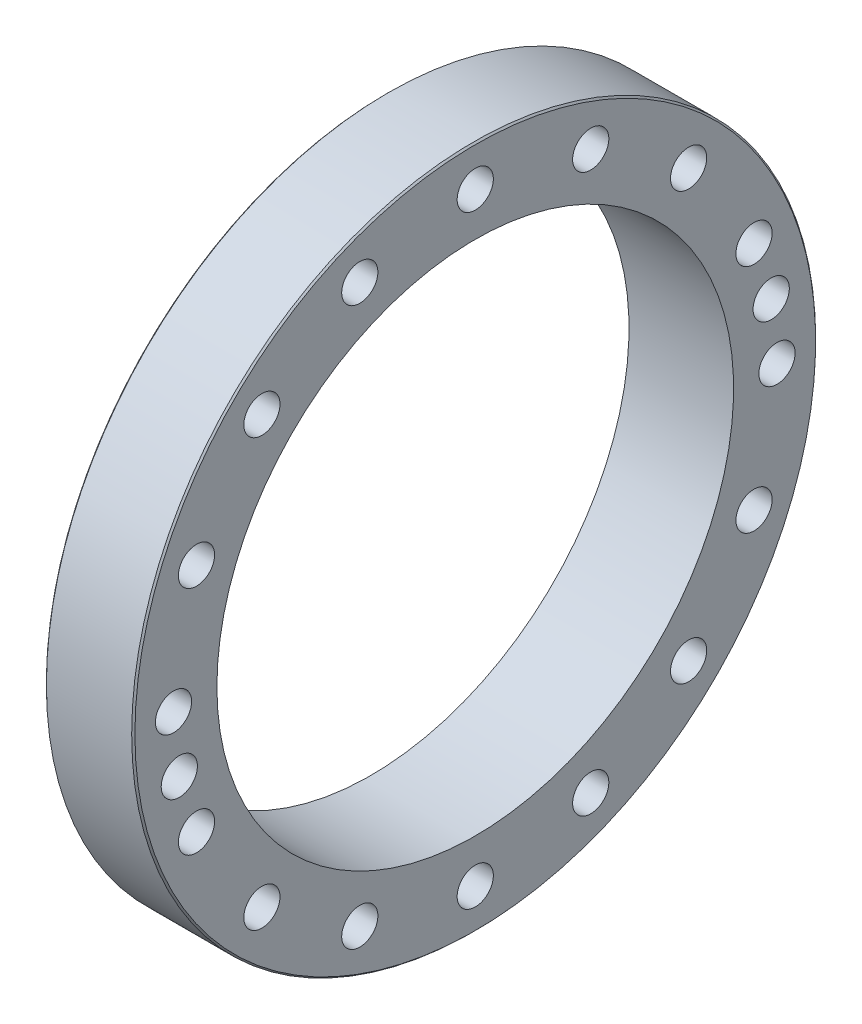
ISO-10303-21;
HEADER;
FILE_DESCRIPTION(('STEP AP214'),'2;1');
FILE_NAME('part.step','',(''),(''),'','','');
FILE_SCHEMA(('AUTOMOTIVE_DESIGN { 1 0 10303 214 1 1 1 1 }'));
ENDSEC;
DATA;
#1=APPLICATION_CONTEXT('core data for automotive mechanical design processes');
#2=APPLICATION_PROTOCOL_DEFINITION('international standard','automotive_design',2000,#1);
#3=PRODUCT_CONTEXT('',#1,'mechanical');
#4=PRODUCT('Part','Part','',(#3));
#5=PRODUCT_RELATED_PRODUCT_CATEGORY('part','',(#4));
#6=PRODUCT_DEFINITION_FORMATION('','',#4);
#7=PRODUCT_DEFINITION_CONTEXT('part definition',#1,'design');
#8=PRODUCT_DEFINITION('design','',#6,#7);
#9=PRODUCT_DEFINITION_SHAPE('','',#8);
#10=(LENGTH_UNIT() NAMED_UNIT(*) SI_UNIT(.MILLI.,.METRE.));
#11=(NAMED_UNIT(*) PLANE_ANGLE_UNIT() SI_UNIT($,.RADIAN.));
#12=(NAMED_UNIT(*) SI_UNIT($,.STERADIAN.) SOLID_ANGLE_UNIT());
#13=UNCERTAINTY_MEASURE_WITH_UNIT(LENGTH_MEASURE(1.E-05),#10,'distance_accuracy_value','');
#14=(GEOMETRIC_REPRESENTATION_CONTEXT(3) GLOBAL_UNCERTAINTY_ASSIGNED_CONTEXT((#13)) GLOBAL_UNIT_ASSIGNED_CONTEXT((#10,
#11,#12)) REPRESENTATION_CONTEXT('',''));
#15=CARTESIAN_POINT('',(0.,0.,0.));
#16=DIRECTION('',(0.,0.,1.));
#17=DIRECTION('',(1.,0.,0.));
#18=AXIS2_PLACEMENT_3D('',#15,#16,#17);
#19=CARTESIAN_POINT('',(47.6,-14.6317741512096,73.5588960302423));
#20=DIRECTION('',(-1.,0.,0.));
#21=DIRECTION('',(0.,0.,1.));
#22=AXIS2_PLACEMENT_3D('',#19,#20,#21);
#23=CYLINDRICAL_SURFACE('',#22,3.35);
#24=CARTESIAN_POINT('',(53.449999999998,-14.6317741512096,73.5588960302423));
#25=DIRECTION('',(1.,0.,0.));
#26=DIRECTION('',(0.,0.19509032201682,-0.980785280403093));
#27=AXIS2_PLACEMENT_3D('',#24,#25,#26);
#28=CIRCLE('',#27,3.34999999997575);
#29=CARTESIAN_POINT('',(53.449999999998,-13.978221572458,70.2732653409157));
#30=VERTEX_POINT('',#29);
#31=EDGE_CURVE('E30',#30,#30,#28,.T.);
#32=ORIENTED_EDGE('',*,*,#31,.T.);
#33=EDGE_LOOP('',(#32));
#34=FACE_BOUND('',#33,.T.);
#35=CARTESIAN_POINT('',(41.7499999999791,-14.6317741512096,73.5588960302423));
#36=DIRECTION('',(-1.,0.,0.));
#37=DIRECTION('',(0.,0.195090322013574,-0.980785280403739));
#38=AXIS2_PLACEMENT_3D('',#35,#36,#37);
#39=CIRCLE('',#38,3.3500000000315);
#40=CARTESIAN_POINT('',(41.7499999999791,-13.978221572458,70.2732653408589));
#41=VERTEX_POINT('',#40);
#42=EDGE_CURVE('E173',#41,#41,#39,.T.);
#43=ORIENTED_EDGE('',*,*,#42,.T.);
#44=EDGE_LOOP('',(#43));
#45=FACE_BOUND('',#44,.T.);
#46=ADVANCED_FACE('F15',(#34,#45),#23,.F.);
#47=CARTESIAN_POINT('',(47.6,14.6317741512096,-73.5588960302423));
#48=DIRECTION('',(-1.,0.,0.));
#49=DIRECTION('',(0.,0.,1.));
#50=AXIS2_PLACEMENT_3D('',#47,#48,#49);
#51=CYLINDRICAL_SURFACE('',#50,3.35);
#52=CARTESIAN_POINT('',(53.449999999998,14.6317741512096,-73.5588960302423));
#53=DIRECTION('',(1.,0.,0.));
#54=DIRECTION('',(0.,-0.19509032201682,0.980785280403093));
#55=AXIS2_PLACEMENT_3D('',#52,#53,#54);
#56=CIRCLE('',#55,3.34999999997575);
#57=CARTESIAN_POINT('',(53.449999999998,13.978221572458,-70.2732653409157));
#58=VERTEX_POINT('',#57);
#59=EDGE_CURVE('E179',#58,#58,#56,.T.);
#60=ORIENTED_EDGE('',*,*,#59,.T.);
#61=EDGE_LOOP('',(#60));
#62=FACE_BOUND('',#61,.T.);
#63=CARTESIAN_POINT('',(41.7499999999791,14.6317741512096,-73.5588960302423));
#64=DIRECTION('',(-1.,0.,0.));
#65=DIRECTION('',(0.,-0.195090322013574,0.980785280403739));
#66=AXIS2_PLACEMENT_3D('',#63,#64,#65);
#67=CIRCLE('',#66,3.3500000000315);
#68=CARTESIAN_POINT('',(41.7499999999791,13.978221572458,-70.2732653408589));
#69=VERTEX_POINT('',#68);
#70=EDGE_CURVE('E168',#69,#69,#67,.T.);
#71=ORIENTED_EDGE('',*,*,#70,.T.);
#72=EDGE_LOOP('',(#71));
#73=FACE_BOUND('',#72,.T.);
#74=ADVANCED_FACE('F191',(#62,#73),#51,.F.);
#75=CARTESIAN_POINT('',(54.1000000000054,-14.6317741512096,73.5588960302423));
#76=DIRECTION('',(1.,0.,0.));
#77=DIRECTION('',(0.,0.,-1.));
#78=AXIS2_PLACEMENT_3D('',#75,#76,#77);
#79=CONICAL_SURFACE('',#78,3.99999999999753,0.785398163408533);
#80=CARTESIAN_POINT('',(54.1000000000072,-14.6317741512096,73.5588960302423));
#81=DIRECTION('',(1.,0.,0.));
#82=DIRECTION('',(0.,0.,-1.));
#83=AXIS2_PLACEMENT_3D('',#80,#81,#82);
#84=CIRCLE('',#83,3.99999999999938);
#85=CARTESIAN_POINT('',(54.1000000000072,-14.6317741512096,69.5588960302429));
#86=VERTEX_POINT('',#85);
#87=EDGE_CURVE('E18',#86,#86,#84,.T.);
#88=ORIENTED_EDGE('',*,*,#87,.T.);
#89=EDGE_LOOP('',(#88));
#90=FACE_BOUND('',#89,.T.);
#91=ORIENTED_EDGE('',*,*,#31,.F.);
#92=EDGE_LOOP('',(#91));
#93=FACE_BOUND('',#92,.T.);
#94=ADVANCED_FACE('F188',(#90,#93),#79,.F.);
#95=CARTESIAN_POINT('',(54.1000000000054,14.6317741512096,-73.5588960302423));
#96=DIRECTION('',(1.,0.,0.));
#97=DIRECTION('',(0.,0.,-1.));
#98=AXIS2_PLACEMENT_3D('',#95,#96,#97);
#99=CONICAL_SURFACE('',#98,3.99999999999753,0.785398163408533);
#100=CARTESIAN_POINT('',(54.1000000000072,14.6317741512096,-73.5588960302423));
#101=DIRECTION('',(1.,0.,0.));
#102=DIRECTION('',(0.,0.,-1.));
#103=AXIS2_PLACEMENT_3D('',#100,#101,#102);
#104=CIRCLE('',#103,3.99999999999938);
#105=CARTESIAN_POINT('',(54.1000000000072,14.6317741512096,-77.5588960302417));
#106=VERTEX_POINT('',#105);
#107=EDGE_CURVE('E159',#106,#106,#104,.T.);
#108=ORIENTED_EDGE('',*,*,#107,.T.);
#109=EDGE_LOOP('',(#108));
#110=FACE_BOUND('',#109,.T.);
#111=ORIENTED_EDGE('',*,*,#59,.F.);
#112=EDGE_LOOP('',(#111));
#113=FACE_BOUND('',#112,.T.);
#114=ADVANCED_FACE('F190',(#110,#113),#99,.F.);
#115=CARTESIAN_POINT('',(41.0999999999149,-14.6317741512096,73.5588960302423));
#116=DIRECTION('',(-1.,0.,0.));
#117=DIRECTION('',(0.,0.,1.));
#118=AXIS2_PLACEMENT_3D('',#115,#116,#117);
#119=CONICAL_SURFACE('',#118,4.00000000005605,0.78539816336694);
#120=ORIENTED_EDGE('',*,*,#42,.F.);
#121=EDGE_LOOP('',(#120));
#122=FACE_BOUND('',#121,.T.);
#123=CARTESIAN_POINT('',(41.0999999999717,-14.6317741512096,73.5588960302423));
#124=DIRECTION('',(-1.,0.,0.));
#125=DIRECTION('',(0.,0.,1.));
#126=AXIS2_PLACEMENT_3D('',#123,#124,#125);
#127=CIRCLE('',#126,3.99999999999921);
#128=CARTESIAN_POINT('',(41.0999999999717,-14.6317741512096,77.5588960302415));
#129=VERTEX_POINT('',#128);
#130=EDGE_CURVE('E157',#129,#129,#127,.F.);
#131=ORIENTED_EDGE('',*,*,#130,.F.);
#132=EDGE_LOOP('',(#131));
#133=FACE_BOUND('',#132,.T.);
#134=ADVANCED_FACE('F198',(#122,#133),#119,.F.);
#135=CARTESIAN_POINT('',(41.0999999999149,14.6317741512096,-73.5588960302423));
#136=DIRECTION('',(-1.,0.,0.));
#137=DIRECTION('',(0.,0.,1.));
#138=AXIS2_PLACEMENT_3D('',#135,#136,#137);
#139=CONICAL_SURFACE('',#138,4.00000000005605,0.78539816336694);
#140=ORIENTED_EDGE('',*,*,#70,.F.);
#141=EDGE_LOOP('',(#140));
#142=FACE_BOUND('',#141,.T.);
#143=CARTESIAN_POINT('',(41.0999999999717,14.6317741512096,-73.5588960302423));
#144=DIRECTION('',(-1.,0.,0.));
#145=DIRECTION('',(0.,0.,1.));
#146=AXIS2_PLACEMENT_3D('',#143,#144,#145);
#147=CIRCLE('',#146,3.99999999999921);
#148=CARTESIAN_POINT('',(41.0999999999717,14.6317741512096,-69.5588960302431));
#149=VERTEX_POINT('',#148);
#150=EDGE_CURVE('E154',#149,#149,#147,.F.);
#151=ORIENTED_EDGE('',*,*,#150,.F.);
#152=EDGE_LOOP('',(#151));
#153=FACE_BOUND('',#152,.T.);
#154=ADVANCED_FACE('F317',(#142,#153),#139,.F.);
#155=CARTESIAN_POINT('',(39.5,0.,0.));
#156=DIRECTION('',(-1.,0.,0.));
#157=DIRECTION('',(0.,0.,1.));
#158=AXIS2_PLACEMENT_3D('',#155,#156,#157);
#159=CYLINDRICAL_SURFACE('',#158,67.5);
#160=CARTESIAN_POINT('',(41.1,0.,0.));
#161=DIRECTION('',(-1.,0.,0.));
#162=DIRECTION('',(0.,0.,1.));
#163=AXIS2_PLACEMENT_3D('',#160,#161,#162);
#164=CIRCLE('',#163,67.5);
#165=CARTESIAN_POINT('',(41.1,0.,67.5));
#166=VERTEX_POINT('',#165);
#167=EDGE_CURVE('E148',#166,#166,#164,.F.);
#168=ORIENTED_EDGE('',*,*,#167,.F.);
#169=EDGE_LOOP('',(#168));
#170=FACE_BOUND('',#169,.T.);
#171=CARTESIAN_POINT('',(37.9,0.,0.));
#172=DIRECTION('',(1.,0.,0.));
#173=DIRECTION('',(0.,0.,1.));
#174=AXIS2_PLACEMENT_3D('',#171,#172,#173);
#175=CIRCLE('',#174,67.5);
#176=CARTESIAN_POINT('',(37.9,0.,67.5));
#177=VERTEX_POINT('',#176);
#178=EDGE_CURVE('E164',#177,#177,#175,.F.);
#179=ORIENTED_EDGE('',*,*,#178,.F.);
#180=EDGE_LOOP('',(#179));
#181=FACE_BOUND('',#180,.T.);
#182=ADVANCED_FACE('F314',(#170,#181),#159,.T.);
#183=CARTESIAN_POINT('',(37.9,0.,0.));
#184=DIRECTION('',(1.,0.,0.));
#185=DIRECTION('',(0.,0.,-1.));
#186=AXIS2_PLACEMENT_3D('',#183,#184,#185);
#187=CONICAL_SURFACE('',#186,67.5,0.785398163397448);
#188=ORIENTED_EDGE('',*,*,#178,.T.);
#189=EDGE_LOOP('',(#188));
#190=FACE_BOUND('',#189,.T.);
#191=CARTESIAN_POINT('',(37.1,0.,0.));
#192=DIRECTION('',(1.,0.,0.));
#193=DIRECTION('',(0.,0.,-1.));
#194=AXIS2_PLACEMENT_3D('',#191,#192,#193);
#195=CIRCLE('',#194,66.7);
#196=CARTESIAN_POINT('',(37.1,0.,-66.7));
#197=VERTEX_POINT('',#196);
#198=EDGE_CURVE('E145',#197,#197,#195,.F.);
#199=ORIENTED_EDGE('',*,*,#198,.F.);
#200=EDGE_LOOP('',(#199));
#201=FACE_BOUND('',#200,.T.);
#202=ADVANCED_FACE('F310',(#190,#201),#187,.T.);
#203=CARTESIAN_POINT('',(41.5,0.,0.));
#204=DIRECTION('',(1.,0.,0.));
#205=DIRECTION('',(0.,1.,0.));
#206=AXIS2_PLACEMENT_3D('',#203,#204,#205);
#207=CONICAL_SURFACE('',#206,85.,0.785398163397457);
#208=CARTESIAN_POINT('',(41.5,0.,0.));
#209=DIRECTION('',(-1.,0.,0.));
#210=DIRECTION('',(0.,0.,1.));
#211=AXIS2_PLACEMENT_3D('',#208,#209,#210);
#212=CIRCLE('',#211,85.);
#213=CARTESIAN_POINT('',(41.5,0.,85.));
#214=VERTEX_POINT('',#213);
#215=EDGE_CURVE('E144',#214,#214,#212,.F.);
#216=ORIENTED_EDGE('',*,*,#215,.F.);
#217=EDGE_LOOP('',(#216));
#218=FACE_BOUND('',#217,.T.);
#219=CARTESIAN_POINT('',(41.1,0.,0.));
#220=DIRECTION('',(1.,0.,0.));
#221=DIRECTION('',(0.,1.,0.));
#222=AXIS2_PLACEMENT_3D('',#219,#220,#221);
#223=CIRCLE('',#222,84.6);
#224=CARTESIAN_POINT('',(41.1,84.6,0.));
#225=VERTEX_POINT('',#224);
#226=EDGE_CURVE('E151',#225,#225,#223,.F.);
#227=ORIENTED_EDGE('',*,*,#226,.F.);
#228=EDGE_LOOP('',(#227));
#229=FACE_BOUND('',#228,.T.);
#230=ADVANCED_FACE('F306',(#218,#229),#207,.T.);
#231=CARTESIAN_POINT('',(54.1,-15.0707273757459,75.7656629111495));
#232=DIRECTION('',(-1.,0.,0.));
#233=DIRECTION('',(0.,0.,1.));
#234=AXIS2_PLACEMENT_3D('',#231,#232,#233);
#235=PLANE('',#234);
#236=CARTESIAN_POINT('',(54.1,-14.6317741512096,73.5588960302423));
#237=DIRECTION('',(-1.,0.,0.));
#238=DIRECTION('',(0.,0.,1.));
#239=AXIS2_PLACEMENT_3D('',#236,#237,#238);
#240=CIRCLE('',#239,4.5);
#241=CARTESIAN_POINT('',(54.1,-14.6317741512096,78.0588960302423));
#242=VERTEX_POINT('',#241);
#243=EDGE_CURVE('E141',#242,#242,#240,.F.);
#244=ORIENTED_EDGE('',*,*,#243,.T.);
#245=EDGE_LOOP('',(#244));
#246=FACE_BOUND('',#245,.T.);
#247=ORIENTED_EDGE('',*,*,#87,.F.);
#248=EDGE_LOOP('',(#247));
#249=FACE_BOUND('',#248,.T.);
#250=ADVANCED_FACE('F302',(#246,#249),#235,.F.);
#251=CARTESIAN_POINT('',(54.1,15.0707273757459,-75.7656629111495));
#252=DIRECTION('',(-1.,0.,0.));
#253=DIRECTION('',(0.,0.,1.));
#254=AXIS2_PLACEMENT_3D('',#251,#252,#253);
#255=PLANE('',#254);
#256=CARTESIAN_POINT('',(54.1,14.6317741512096,-73.5588960302423));
#257=DIRECTION('',(-1.,0.,0.));
#258=DIRECTION('',(0.,0.,1.));
#259=AXIS2_PLACEMENT_3D('',#256,#257,#258);
#260=CIRCLE('',#259,4.5);
#261=CARTESIAN_POINT('',(54.1,14.6317741512096,-69.0588960302423));
#262=VERTEX_POINT('',#261);
#263=EDGE_CURVE('E138',#262,#262,#260,.F.);
#264=ORIENTED_EDGE('',*,*,#263,.T.);
#265=EDGE_LOOP('',(#264));
#266=FACE_BOUND('',#265,.T.);
#267=ORIENTED_EDGE('',*,*,#107,.F.);
#268=EDGE_LOOP('',(#267));
#269=FACE_BOUND('',#268,.T.);
#270=ADVANCED_FACE('F298',(#266,#269),#255,.F.);
#271=CARTESIAN_POINT('',(41.1,0.,76.05));
#272=DIRECTION('',(-1.,0.,0.));
#273=DIRECTION('',(0.,0.,1.));
#274=AXIS2_PLACEMENT_3D('',#271,#272,#273);
#275=PLANE('',#274);
#276=ORIENTED_EDGE('',*,*,#167,.T.);
#277=EDGE_LOOP('',(#276));
#278=FACE_BOUND('',#277,.T.);
#279=ORIENTED_EDGE('',*,*,#226,.T.);
#280=EDGE_LOOP('',(#279));
#281=FACE_BOUND('',#280,.T.);
#282=CARTESIAN_POINT('',(41.1,0.,-75.));
#283=DIRECTION('',(-1.,0.,0.));
#284=DIRECTION('',(0.,0.,1.));
#285=AXIS2_PLACEMENT_3D('',#282,#283,#284);
#286=CIRCLE('',#285,4.5);
#287=CARTESIAN_POINT('',(41.1,0.,-70.5));
#288=VERTEX_POINT('',#287);
#289=EDGE_CURVE('E90',#288,#288,#286,.F.);
#290=ORIENTED_EDGE('',*,*,#289,.T.);
#291=EDGE_LOOP('',(#290));
#292=FACE_BOUND('',#291,.T.);
#293=CARTESIAN_POINT('',(41.1,28.7012574273817,-69.2909649383465));
#294=DIRECTION('',(-1.,0.,0.));
#295=DIRECTION('',(0.,0.,1.));
#296=AXIS2_PLACEMENT_3D('',#293,#294,#295);
#297=CIRCLE('',#296,4.5);
#298=CARTESIAN_POINT('',(41.1,28.7012574273817,-64.7909649383465));
#299=VERTEX_POINT('',#298);
#300=EDGE_CURVE('E93',#299,#299,#297,.F.);
#301=ORIENTED_EDGE('',*,*,#300,.T.);
#302=EDGE_LOOP('',(#301));
#303=FACE_BOUND('',#302,.T.);
#304=CARTESIAN_POINT('',(41.1,53.0330085889911,-53.0330085889911));
#305=DIRECTION('',(-1.,0.,0.));
#306=DIRECTION('',(0.,0.,1.));
#307=AXIS2_PLACEMENT_3D('',#304,#305,#306);
#308=CIRCLE('',#307,4.5);
#309=CARTESIAN_POINT('',(41.1,53.0330085889911,-48.5330085889911));
#310=VERTEX_POINT('',#309);
#311=EDGE_CURVE('E96',#310,#310,#308,.F.);
#312=ORIENTED_EDGE('',*,*,#311,.T.);
#313=EDGE_LOOP('',(#312));
#314=FACE_BOUND('',#313,.T.);
#315=CARTESIAN_POINT('',(41.1,69.2909649383465,-28.7012574273817));
#316=DIRECTION('',(-1.,0.,0.));
#317=DIRECTION('',(0.,0.,1.));
#318=AXIS2_PLACEMENT_3D('',#315,#316,#317);
#319=CIRCLE('',#318,4.5);
#320=CARTESIAN_POINT('',(41.1,69.2909649383465,-24.2012574273817));
#321=VERTEX_POINT('',#320);
#322=EDGE_CURVE('E99',#321,#321,#319,.F.);
#323=ORIENTED_EDGE('',*,*,#322,.T.);
#324=EDGE_LOOP('',(#323));
#325=FACE_BOUND('',#324,.T.);
#326=CARTESIAN_POINT('',(41.1,75.,0.));
#327=DIRECTION('',(-1.,0.,0.));
#328=DIRECTION('',(0.,0.,1.));
#329=AXIS2_PLACEMENT_3D('',#326,#327,#328);
#330=CIRCLE('',#329,4.5);
#331=CARTESIAN_POINT('',(41.1,75.,4.5));
#332=VERTEX_POINT('',#331);
#333=EDGE_CURVE('E102',#332,#332,#330,.F.);
#334=ORIENTED_EDGE('',*,*,#333,.T.);
#335=EDGE_LOOP('',(#334));
#336=FACE_BOUND('',#335,.T.);
#337=CARTESIAN_POINT('',(41.1,69.2909649383465,28.7012574273817));
#338=DIRECTION('',(-1.,0.,0.));
#339=DIRECTION('',(0.,0.,1.));
#340=AXIS2_PLACEMENT_3D('',#337,#338,#339);
#341=CIRCLE('',#340,4.5);
#342=CARTESIAN_POINT('',(41.1,69.2909649383465,33.2012574273817));
#343=VERTEX_POINT('',#342);
#344=EDGE_CURVE('E105',#343,#343,#341,.F.);
#345=ORIENTED_EDGE('',*,*,#344,.T.);
#346=EDGE_LOOP('',(#345));
#347=FACE_BOUND('',#346,.T.);
#348=CARTESIAN_POINT('',(41.1,53.0330085889911,53.0330085889911));
#349=DIRECTION('',(-1.,0.,0.));
#350=DIRECTION('',(0.,0.,1.));
#351=AXIS2_PLACEMENT_3D('',#348,#349,#350);
#352=CIRCLE('',#351,4.5);
#353=CARTESIAN_POINT('',(41.1,53.0330085889911,57.5330085889911));
#354=VERTEX_POINT('',#353);
#355=EDGE_CURVE('E108',#354,#354,#352,.F.);
#356=ORIENTED_EDGE('',*,*,#355,.T.);
#357=EDGE_LOOP('',(#356));
#358=FACE_BOUND('',#357,.T.);
#359=CARTESIAN_POINT('',(41.1,28.7012574273817,69.2909649383465));
#360=DIRECTION('',(-1.,0.,0.));
#361=DIRECTION('',(0.,0.,1.));
#362=AXIS2_PLACEMENT_3D('',#359,#360,#361);
#363=CIRCLE('',#362,4.5);
#364=CARTESIAN_POINT('',(41.1,28.7012574273817,73.7909649383465));
#365=VERTEX_POINT('',#364);
#366=EDGE_CURVE('E111',#365,#365,#363,.F.);
#367=ORIENTED_EDGE('',*,*,#366,.T.);
#368=EDGE_LOOP('',(#367));
#369=FACE_BOUND('',#368,.T.);
#370=CARTESIAN_POINT('',(41.1,0.,75.));
#371=DIRECTION('',(-1.,0.,0.));
#372=DIRECTION('',(0.,0.,1.));
#373=AXIS2_PLACEMENT_3D('',#370,#371,#372);
#374=CIRCLE('',#373,4.5);
#375=CARTESIAN_POINT('',(41.1,0.,79.5));
#376=VERTEX_POINT('',#375);
#377=EDGE_CURVE('E114',#376,#376,#374,.F.);
#378=ORIENTED_EDGE('',*,*,#377,.T.);
#379=EDGE_LOOP('',(#378));
#380=FACE_BOUND('',#379,.T.);
#381=CARTESIAN_POINT('',(41.1,-28.7012574273817,69.2909649383465));
#382=DIRECTION('',(-1.,0.,0.));
#383=DIRECTION('',(0.,0.,1.));
#384=AXIS2_PLACEMENT_3D('',#381,#382,#383);
#385=CIRCLE('',#384,4.5);
#386=CARTESIAN_POINT('',(41.1,-28.7012574273817,73.7909649383465));
#387=VERTEX_POINT('',#386);
#388=EDGE_CURVE('E117',#387,#387,#385,.F.);
#389=ORIENTED_EDGE('',*,*,#388,.T.);
#390=EDGE_LOOP('',(#389));
#391=FACE_BOUND('',#390,.T.);
#392=CARTESIAN_POINT('',(41.1,-53.0330085889911,53.0330085889911));
#393=DIRECTION('',(-1.,0.,0.));
#394=DIRECTION('',(0.,0.,1.));
#395=AXIS2_PLACEMENT_3D('',#392,#393,#394);
#396=CIRCLE('',#395,4.5);
#397=CARTESIAN_POINT('',(41.1,-53.0330085889911,57.5330085889911));
#398=VERTEX_POINT('',#397);
#399=EDGE_CURVE('E120',#398,#398,#396,.F.);
#400=ORIENTED_EDGE('',*,*,#399,.T.);
#401=EDGE_LOOP('',(#400));
#402=FACE_BOUND('',#401,.T.);
#403=CARTESIAN_POINT('',(41.1,-69.2909649383465,28.7012574273817));
#404=DIRECTION('',(-1.,0.,0.));
#405=DIRECTION('',(0.,0.,1.));
#406=AXIS2_PLACEMENT_3D('',#403,#404,#405);
#407=CIRCLE('',#406,4.5);
#408=CARTESIAN_POINT('',(41.1,-69.2909649383465,33.2012574273817));
#409=VERTEX_POINT('',#408);
#410=EDGE_CURVE('E123',#409,#409,#407,.F.);
#411=ORIENTED_EDGE('',*,*,#410,.T.);
#412=EDGE_LOOP('',(#411));
#413=FACE_BOUND('',#412,.T.);
#414=CARTESIAN_POINT('',(41.1,-75.,0.));
#415=DIRECTION('',(-1.,0.,0.));
#416=DIRECTION('',(0.,0.,1.));
#417=AXIS2_PLACEMENT_3D('',#414,#415,#416);
#418=CIRCLE('',#417,4.5);
#419=CARTESIAN_POINT('',(41.1,-75.,4.5));
#420=VERTEX_POINT('',#419);
#421=EDGE_CURVE('E126',#420,#420,#418,.F.);
#422=ORIENTED_EDGE('',*,*,#421,.T.);
#423=EDGE_LOOP('',(#422));
#424=FACE_BOUND('',#423,.T.);
#425=CARTESIAN_POINT('',(41.1,-69.2909649383465,-28.7012574273818));
#426=DIRECTION('',(-1.,0.,0.));
#427=DIRECTION('',(0.,0.,1.));
#428=AXIS2_PLACEMENT_3D('',#425,#426,#427);
#429=CIRCLE('',#428,4.5);
#430=CARTESIAN_POINT('',(41.1,-69.2909649383465,-24.2012574273818));
#431=VERTEX_POINT('',#430);
#432=EDGE_CURVE('E129',#431,#431,#429,.F.);
#433=ORIENTED_EDGE('',*,*,#432,.T.);
#434=EDGE_LOOP('',(#433));
#435=FACE_BOUND('',#434,.T.);
#436=CARTESIAN_POINT('',(41.1,-53.033008588991,-53.0330085889911));
#437=DIRECTION('',(-1.,0.,0.));
#438=DIRECTION('',(0.,0.,1.));
#439=AXIS2_PLACEMENT_3D('',#436,#437,#438);
#440=CIRCLE('',#439,4.5);
#441=CARTESIAN_POINT('',(41.1,-53.033008588991,-48.5330085889911));
#442=VERTEX_POINT('',#441);
#443=EDGE_CURVE('E132',#442,#442,#440,.F.);
#444=ORIENTED_EDGE('',*,*,#443,.T.);
#445=EDGE_LOOP('',(#444));
#446=FACE_BOUND('',#445,.T.);
#447=CARTESIAN_POINT('',(41.1,-28.7012574273817,-69.2909649383465));
#448=DIRECTION('',(-1.,0.,0.));
#449=DIRECTION('',(0.,0.,1.));
#450=AXIS2_PLACEMENT_3D('',#447,#448,#449);
#451=CIRCLE('',#450,4.5);
#452=CARTESIAN_POINT('',(41.1,-28.7012574273817,-64.7909649383465));
#453=VERTEX_POINT('',#452);
#454=EDGE_CURVE('E135',#453,#453,#451,.F.);
#455=ORIENTED_EDGE('',*,*,#454,.T.);
#456=EDGE_LOOP('',(#455));
#457=FACE_BOUND('',#456,.T.);
#458=ORIENTED_EDGE('',*,*,#150,.T.);
#459=EDGE_LOOP('',(#458));
#460=FACE_BOUND('',#459,.T.);
#461=ORIENTED_EDGE('',*,*,#130,.T.);
#462=EDGE_LOOP('',(#461));
#463=FACE_BOUND('',#462,.T.);
#464=ADVANCED_FACE('F294',(#278,#281,#292,#303,#314,#325,#336,#347,#358,#369,#380,#391,#402,
#413,#424,#435,#446,#457,#460,#463),#275,.T.);
#465=CARTESIAN_POINT('',(37.1,0.,65.4595));
#466=DIRECTION('',(-1.,0.,0.));
#467=DIRECTION('',(0.,0.,1.));
#468=AXIS2_PLACEMENT_3D('',#465,#466,#467);
#469=PLANE('',#468);
#470=CARTESIAN_POINT('',(37.1,0.,0.));
#471=DIRECTION('',(-1.,0.,0.));
#472=DIRECTION('',(0.,0.,1.));
#473=AXIS2_PLACEMENT_3D('',#470,#471,#472);
#474=CIRCLE('',#473,64.219);
#475=CARTESIAN_POINT('',(37.1,0.,64.219));
#476=VERTEX_POINT('',#475);
#477=EDGE_CURVE('E87',#476,#476,#474,.F.);
#478=ORIENTED_EDGE('',*,*,#477,.T.);
#479=EDGE_LOOP('',(#478));
#480=FACE_BOUND('',#479,.T.);
#481=ORIENTED_EDGE('',*,*,#198,.T.);
#482=EDGE_LOOP('',(#481));
#483=FACE_BOUND('',#482,.T.);
#484=ADVANCED_FACE('F290',(#480,#483),#469,.T.);
#485=CARTESIAN_POINT('',(52.1,0.,0.));
#486=DIRECTION('',(-1.,0.,0.));
#487=DIRECTION('',(0.,0.,1.));
#488=AXIS2_PLACEMENT_3D('',#485,#486,#487);
#489=CYLINDRICAL_SURFACE('',#488,85.);
#490=CARTESIAN_POINT('',(62.7,0.,0.));
#491=DIRECTION('',(-1.,0.,0.));
#492=DIRECTION('',(0.,0.,1.));
#493=AXIS2_PLACEMENT_3D('',#490,#491,#492);
#494=CIRCLE('',#493,85.);
#495=CARTESIAN_POINT('',(62.7,0.,85.));
#496=VERTEX_POINT('',#495);
#497=EDGE_CURVE('E86',#496,#496,#494,.F.);
#498=ORIENTED_EDGE('',*,*,#497,.F.);
#499=EDGE_LOOP('',(#498));
#500=FACE_BOUND('',#499,.T.);
#501=ORIENTED_EDGE('',*,*,#215,.T.);
#502=EDGE_LOOP('',(#501));
#503=FACE_BOUND('',#502,.T.);
#504=ADVANCED_FACE('F286',(#500,#503),#489,.T.);
#505=CARTESIAN_POINT('',(58.6,-14.6317741512096,73.5588960302423));
#506=DIRECTION('',(-1.,0.,0.));
#507=DIRECTION('',(0.,0.,1.));
#508=AXIS2_PLACEMENT_3D('',#505,#506,#507);
#509=CYLINDRICAL_SURFACE('',#508,4.5);
#510=CARTESIAN_POINT('',(63.1,-14.6317741512096,73.5588960302423));
#511=DIRECTION('',(-1.,0.,0.));
#512=DIRECTION('',(0.,0.,1.));
#513=AXIS2_PLACEMENT_3D('',#510,#511,#512);
#514=CIRCLE('',#513,4.5);
#515=CARTESIAN_POINT('',(63.1,-14.6317741512096,78.0588960302423));
#516=VERTEX_POINT('',#515);
#517=EDGE_CURVE('E83',#516,#516,#514,.T.);
#518=ORIENTED_EDGE('',*,*,#517,.F.);
#519=EDGE_LOOP('',(#518));
#520=FACE_BOUND('',#519,.T.);
#521=ORIENTED_EDGE('',*,*,#243,.F.);
#522=EDGE_LOOP('',(#521));
#523=FACE_BOUND('',#522,.T.);
#524=ADVANCED_FACE('F282',(#520,#523),#509,.F.);
#525=CARTESIAN_POINT('',(58.6,14.6317741512096,-73.5588960302423));
#526=DIRECTION('',(-1.,0.,0.));
#527=DIRECTION('',(0.,0.,1.));
#528=AXIS2_PLACEMENT_3D('',#525,#526,#527);
#529=CYLINDRICAL_SURFACE('',#528,4.5);
#530=CARTESIAN_POINT('',(63.1,14.6317741512096,-73.5588960302423));
#531=DIRECTION('',(-1.,0.,0.));
#532=DIRECTION('',(0.,0.,1.));
#533=AXIS2_PLACEMENT_3D('',#530,#531,#532);
#534=CIRCLE('',#533,4.5);
#535=CARTESIAN_POINT('',(63.1,14.6317741512096,-69.0588960302423));
#536=VERTEX_POINT('',#535);
#537=EDGE_CURVE('E80',#536,#536,#534,.T.);
#538=ORIENTED_EDGE('',*,*,#537,.F.);
#539=EDGE_LOOP('',(#538));
#540=FACE_BOUND('',#539,.T.);
#541=ORIENTED_EDGE('',*,*,#263,.F.);
#542=EDGE_LOOP('',(#541));
#543=FACE_BOUND('',#542,.T.);
#544=ADVANCED_FACE('F278',(#540,#543),#529,.F.);
#545=CARTESIAN_POINT('',(52.1,-28.7012574273817,-69.2909649383465));
#546=DIRECTION('',(-1.,0.,0.));
#547=DIRECTION('',(0.,0.,1.));
#548=AXIS2_PLACEMENT_3D('',#545,#546,#547);
#549=CYLINDRICAL_SURFACE('',#548,4.5);
#550=CARTESIAN_POINT('',(63.1,-28.7012574273817,-69.2909649383465));
#551=DIRECTION('',(-1.,0.,0.));
#552=DIRECTION('',(0.,0.,1.));
#553=AXIS2_PLACEMENT_3D('',#550,#551,#552);
#554=CIRCLE('',#553,4.5);
#555=CARTESIAN_POINT('',(63.1,-28.7012574273817,-64.7909649383465));
#556=VERTEX_POINT('',#555);
#557=EDGE_CURVE('E77',#556,#556,#554,.T.);
#558=ORIENTED_EDGE('',*,*,#557,.F.);
#559=EDGE_LOOP('',(#558));
#560=FACE_BOUND('',#559,.T.);
#561=ORIENTED_EDGE('',*,*,#454,.F.);
#562=EDGE_LOOP('',(#561));
#563=FACE_BOUND('',#562,.T.);
#564=ADVANCED_FACE('F274',(#560,#563),#549,.F.);
#565=CARTESIAN_POINT('',(52.1,-53.033008588991,-53.0330085889911));
#566=DIRECTION('',(-1.,0.,0.));
#567=DIRECTION('',(0.,0.,1.));
#568=AXIS2_PLACEMENT_3D('',#565,#566,#567);
#569=CYLINDRICAL_SURFACE('',#568,4.5);
#570=CARTESIAN_POINT('',(63.1,-53.033008588991,-53.0330085889911));
#571=DIRECTION('',(-1.,0.,0.));
#572=DIRECTION('',(0.,0.,1.));
#573=AXIS2_PLACEMENT_3D('',#570,#571,#572);
#574=CIRCLE('',#573,4.5);
#575=CARTESIAN_POINT('',(63.1,-53.033008588991,-48.5330085889911));
#576=VERTEX_POINT('',#575);
#577=EDGE_CURVE('E74',#576,#576,#574,.T.);
#578=ORIENTED_EDGE('',*,*,#577,.F.);
#579=EDGE_LOOP('',(#578));
#580=FACE_BOUND('',#579,.T.);
#581=ORIENTED_EDGE('',*,*,#443,.F.);
#582=EDGE_LOOP('',(#581));
#583=FACE_BOUND('',#582,.T.);
#584=ADVANCED_FACE('F270',(#580,#583),#569,.F.);
#585=CARTESIAN_POINT('',(52.1,-69.2909649383465,-28.7012574273818));
#586=DIRECTION('',(-1.,0.,0.));
#587=DIRECTION('',(0.,0.,1.));
#588=AXIS2_PLACEMENT_3D('',#585,#586,#587);
#589=CYLINDRICAL_SURFACE('',#588,4.5);
#590=CARTESIAN_POINT('',(63.1,-69.2909649383465,-28.7012574273818));
#591=DIRECTION('',(-1.,0.,0.));
#592=DIRECTION('',(0.,0.,1.));
#593=AXIS2_PLACEMENT_3D('',#590,#591,#592);
#594=CIRCLE('',#593,4.5);
#595=CARTESIAN_POINT('',(63.1,-69.2909649383465,-24.2012574273818));
#596=VERTEX_POINT('',#595);
#597=EDGE_CURVE('E71',#596,#596,#594,.T.);
#598=ORIENTED_EDGE('',*,*,#597,.F.);
#599=EDGE_LOOP('',(#598));
#600=FACE_BOUND('',#599,.T.);
#601=ORIENTED_EDGE('',*,*,#432,.F.);
#602=EDGE_LOOP('',(#601));
#603=FACE_BOUND('',#602,.T.);
#604=ADVANCED_FACE('F266',(#600,#603),#589,.F.);
#605=CARTESIAN_POINT('',(52.1,-75.,0.));
#606=DIRECTION('',(-1.,0.,0.));
#607=DIRECTION('',(0.,0.,1.));
#608=AXIS2_PLACEMENT_3D('',#605,#606,#607);
#609=CYLINDRICAL_SURFACE('',#608,4.5);
#610=CARTESIAN_POINT('',(63.1,-75.,0.));
#611=DIRECTION('',(-1.,0.,0.));
#612=DIRECTION('',(0.,0.,1.));
#613=AXIS2_PLACEMENT_3D('',#610,#611,#612);
#614=CIRCLE('',#613,4.5);
#615=CARTESIAN_POINT('',(63.1,-75.,4.5));
#616=VERTEX_POINT('',#615);
#617=EDGE_CURVE('E68',#616,#616,#614,.T.);
#618=ORIENTED_EDGE('',*,*,#617,.F.);
#619=EDGE_LOOP('',(#618));
#620=FACE_BOUND('',#619,.T.);
#621=ORIENTED_EDGE('',*,*,#421,.F.);
#622=EDGE_LOOP('',(#621));
#623=FACE_BOUND('',#622,.T.);
#624=ADVANCED_FACE('F262',(#620,#623),#609,.F.);
#625=CARTESIAN_POINT('',(52.1,-69.2909649383465,28.7012574273817));
#626=DIRECTION('',(-1.,0.,0.));
#627=DIRECTION('',(0.,0.,1.));
#628=AXIS2_PLACEMENT_3D('',#625,#626,#627);
#629=CYLINDRICAL_SURFACE('',#628,4.5);
#630=CARTESIAN_POINT('',(63.1,-69.2909649383465,28.7012574273817));
#631=DIRECTION('',(-1.,0.,0.));
#632=DIRECTION('',(0.,0.,1.));
#633=AXIS2_PLACEMENT_3D('',#630,#631,#632);
#634=CIRCLE('',#633,4.5);
#635=CARTESIAN_POINT('',(63.1,-69.2909649383465,33.2012574273817));
#636=VERTEX_POINT('',#635);
#637=EDGE_CURVE('E65',#636,#636,#634,.T.);
#638=ORIENTED_EDGE('',*,*,#637,.F.);
#639=EDGE_LOOP('',(#638));
#640=FACE_BOUND('',#639,.T.);
#641=ORIENTED_EDGE('',*,*,#410,.F.);
#642=EDGE_LOOP('',(#641));
#643=FACE_BOUND('',#642,.T.);
#644=ADVANCED_FACE('F258',(#640,#643),#629,.F.);
#645=CARTESIAN_POINT('',(52.1,-53.0330085889911,53.0330085889911));
#646=DIRECTION('',(-1.,0.,0.));
#647=DIRECTION('',(0.,0.,1.));
#648=AXIS2_PLACEMENT_3D('',#645,#646,#647);
#649=CYLINDRICAL_SURFACE('',#648,4.5);
#650=CARTESIAN_POINT('',(63.1,-53.0330085889911,53.0330085889911));
#651=DIRECTION('',(-1.,0.,0.));
#652=DIRECTION('',(0.,0.,1.));
#653=AXIS2_PLACEMENT_3D('',#650,#651,#652);
#654=CIRCLE('',#653,4.5);
#655=CARTESIAN_POINT('',(63.1,-53.0330085889911,57.5330085889911));
#656=VERTEX_POINT('',#655);
#657=EDGE_CURVE('E62',#656,#656,#654,.T.);
#658=ORIENTED_EDGE('',*,*,#657,.F.);
#659=EDGE_LOOP('',(#658));
#660=FACE_BOUND('',#659,.T.);
#661=ORIENTED_EDGE('',*,*,#399,.F.);
#662=EDGE_LOOP('',(#661));
#663=FACE_BOUND('',#662,.T.);
#664=ADVANCED_FACE('F254',(#660,#663),#649,.F.);
#665=CARTESIAN_POINT('',(52.1,-28.7012574273817,69.2909649383465));
#666=DIRECTION('',(-1.,0.,0.));
#667=DIRECTION('',(0.,0.,1.));
#668=AXIS2_PLACEMENT_3D('',#665,#666,#667);
#669=CYLINDRICAL_SURFACE('',#668,4.5);
#670=CARTESIAN_POINT('',(63.1,-28.7012574273817,69.2909649383465));
#671=DIRECTION('',(-1.,0.,0.));
#672=DIRECTION('',(0.,0.,1.));
#673=AXIS2_PLACEMENT_3D('',#670,#671,#672);
#674=CIRCLE('',#673,4.5);
#675=CARTESIAN_POINT('',(63.1,-28.7012574273817,73.7909649383465));
#676=VERTEX_POINT('',#675);
#677=EDGE_CURVE('E59',#676,#676,#674,.T.);
#678=ORIENTED_EDGE('',*,*,#677,.F.);
#679=EDGE_LOOP('',(#678));
#680=FACE_BOUND('',#679,.T.);
#681=ORIENTED_EDGE('',*,*,#388,.F.);
#682=EDGE_LOOP('',(#681));
#683=FACE_BOUND('',#682,.T.);
#684=ADVANCED_FACE('F250',(#680,#683),#669,.F.);
#685=CARTESIAN_POINT('',(52.1,0.,75.));
#686=DIRECTION('',(-1.,0.,0.));
#687=DIRECTION('',(0.,0.,1.));
#688=AXIS2_PLACEMENT_3D('',#685,#686,#687);
#689=CYLINDRICAL_SURFACE('',#688,4.5);
#690=CARTESIAN_POINT('',(63.1,0.,75.));
#691=DIRECTION('',(-1.,0.,0.));
#692=DIRECTION('',(0.,0.,1.));
#693=AXIS2_PLACEMENT_3D('',#690,#691,#692);
#694=CIRCLE('',#693,4.5);
#695=CARTESIAN_POINT('',(63.1,0.,79.5));
#696=VERTEX_POINT('',#695);
#697=EDGE_CURVE('E56',#696,#696,#694,.T.);
#698=ORIENTED_EDGE('',*,*,#697,.F.);
#699=EDGE_LOOP('',(#698));
#700=FACE_BOUND('',#699,.T.);
#701=ORIENTED_EDGE('',*,*,#377,.F.);
#702=EDGE_LOOP('',(#701));
#703=FACE_BOUND('',#702,.T.);
#704=ADVANCED_FACE('F246',(#700,#703),#689,.F.);
#705=CARTESIAN_POINT('',(52.1,28.7012574273817,69.2909649383465));
#706=DIRECTION('',(-1.,0.,0.));
#707=DIRECTION('',(0.,0.,1.));
#708=AXIS2_PLACEMENT_3D('',#705,#706,#707);
#709=CYLINDRICAL_SURFACE('',#708,4.5);
#710=CARTESIAN_POINT('',(63.1,28.7012574273817,69.2909649383465));
#711=DIRECTION('',(-1.,0.,0.));
#712=DIRECTION('',(0.,0.,1.));
#713=AXIS2_PLACEMENT_3D('',#710,#711,#712);
#714=CIRCLE('',#713,4.5);
#715=CARTESIAN_POINT('',(63.1,28.7012574273817,73.7909649383465));
#716=VERTEX_POINT('',#715);
#717=EDGE_CURVE('E53',#716,#716,#714,.T.);
#718=ORIENTED_EDGE('',*,*,#717,.F.);
#719=EDGE_LOOP('',(#718));
#720=FACE_BOUND('',#719,.T.);
#721=ORIENTED_EDGE('',*,*,#366,.F.);
#722=EDGE_LOOP('',(#721));
#723=FACE_BOUND('',#722,.T.);
#724=ADVANCED_FACE('F242',(#720,#723),#709,.F.);
#725=CARTESIAN_POINT('',(52.1,53.0330085889911,53.0330085889911));
#726=DIRECTION('',(-1.,0.,0.));
#727=DIRECTION('',(0.,0.,1.));
#728=AXIS2_PLACEMENT_3D('',#725,#726,#727);
#729=CYLINDRICAL_SURFACE('',#728,4.5);
#730=CARTESIAN_POINT('',(63.1,53.0330085889911,53.0330085889911));
#731=DIRECTION('',(-1.,0.,0.));
#732=DIRECTION('',(0.,0.,1.));
#733=AXIS2_PLACEMENT_3D('',#730,#731,#732);
#734=CIRCLE('',#733,4.5);
#735=CARTESIAN_POINT('',(63.1,53.0330085889911,57.5330085889911));
#736=VERTEX_POINT('',#735);
#737=EDGE_CURVE('E50',#736,#736,#734,.T.);
#738=ORIENTED_EDGE('',*,*,#737,.F.);
#739=EDGE_LOOP('',(#738));
#740=FACE_BOUND('',#739,.T.);
#741=ORIENTED_EDGE('',*,*,#355,.F.);
#742=EDGE_LOOP('',(#741));
#743=FACE_BOUND('',#742,.T.);
#744=ADVANCED_FACE('F238',(#740,#743),#729,.F.);
#745=CARTESIAN_POINT('',(52.1,69.2909649383465,28.7012574273817));
#746=DIRECTION('',(-1.,0.,0.));
#747=DIRECTION('',(0.,0.,1.));
#748=AXIS2_PLACEMENT_3D('',#745,#746,#747);
#749=CYLINDRICAL_SURFACE('',#748,4.5);
#750=CARTESIAN_POINT('',(63.1,69.2909649383465,28.7012574273817));
#751=DIRECTION('',(-1.,0.,0.));
#752=DIRECTION('',(0.,0.,1.));
#753=AXIS2_PLACEMENT_3D('',#750,#751,#752);
#754=CIRCLE('',#753,4.5);
#755=CARTESIAN_POINT('',(63.1,69.2909649383465,33.2012574273817));
#756=VERTEX_POINT('',#755);
#757=EDGE_CURVE('E47',#756,#756,#754,.T.);
#758=ORIENTED_EDGE('',*,*,#757,.F.);
#759=EDGE_LOOP('',(#758));
#760=FACE_BOUND('',#759,.T.);
#761=ORIENTED_EDGE('',*,*,#344,.F.);
#762=EDGE_LOOP('',(#761));
#763=FACE_BOUND('',#762,.T.);
#764=ADVANCED_FACE('F234',(#760,#763),#749,.F.);
#765=CARTESIAN_POINT('',(52.1,75.,0.));
#766=DIRECTION('',(-1.,0.,0.));
#767=DIRECTION('',(0.,0.,1.));
#768=AXIS2_PLACEMENT_3D('',#765,#766,#767);
#769=CYLINDRICAL_SURFACE('',#768,4.5);
#770=CARTESIAN_POINT('',(63.1,75.,0.));
#771=DIRECTION('',(-1.,0.,0.));
#772=DIRECTION('',(0.,0.,1.));
#773=AXIS2_PLACEMENT_3D('',#770,#771,#772);
#774=CIRCLE('',#773,4.5);
#775=CARTESIAN_POINT('',(63.1,75.,4.5));
#776=VERTEX_POINT('',#775);
#777=EDGE_CURVE('E44',#776,#776,#774,.T.);
#778=ORIENTED_EDGE('',*,*,#777,.F.);
#779=EDGE_LOOP('',(#778));
#780=FACE_BOUND('',#779,.T.);
#781=ORIENTED_EDGE('',*,*,#333,.F.);
#782=EDGE_LOOP('',(#781));
#783=FACE_BOUND('',#782,.T.);
#784=ADVANCED_FACE('F230',(#780,#783),#769,.F.);
#785=CARTESIAN_POINT('',(52.1,69.2909649383465,-28.7012574273817));
#786=DIRECTION('',(-1.,0.,0.));
#787=DIRECTION('',(0.,0.,1.));
#788=AXIS2_PLACEMENT_3D('',#785,#786,#787);
#789=CYLINDRICAL_SURFACE('',#788,4.5);
#790=CARTESIAN_POINT('',(63.1,69.2909649383465,-28.7012574273817));
#791=DIRECTION('',(-1.,0.,0.));
#792=DIRECTION('',(0.,0.,1.));
#793=AXIS2_PLACEMENT_3D('',#790,#791,#792);
#794=CIRCLE('',#793,4.5);
#795=CARTESIAN_POINT('',(63.1,69.2909649383465,-24.2012574273817));
#796=VERTEX_POINT('',#795);
#797=EDGE_CURVE('E41',#796,#796,#794,.T.);
#798=ORIENTED_EDGE('',*,*,#797,.F.);
#799=EDGE_LOOP('',(#798));
#800=FACE_BOUND('',#799,.T.);
#801=ORIENTED_EDGE('',*,*,#322,.F.);
#802=EDGE_LOOP('',(#801));
#803=FACE_BOUND('',#802,.T.);
#804=ADVANCED_FACE('F226',(#800,#803),#789,.F.);
#805=CARTESIAN_POINT('',(52.1,53.0330085889911,-53.0330085889911));
#806=DIRECTION('',(-1.,0.,0.));
#807=DIRECTION('',(0.,0.,1.));
#808=AXIS2_PLACEMENT_3D('',#805,#806,#807);
#809=CYLINDRICAL_SURFACE('',#808,4.5);
#810=CARTESIAN_POINT('',(63.1,53.0330085889911,-53.0330085889911));
#811=DIRECTION('',(-1.,0.,0.));
#812=DIRECTION('',(0.,0.,1.));
#813=AXIS2_PLACEMENT_3D('',#810,#811,#812);
#814=CIRCLE('',#813,4.5);
#815=CARTESIAN_POINT('',(63.1,53.0330085889911,-48.5330085889911));
#816=VERTEX_POINT('',#815);
#817=EDGE_CURVE('E38',#816,#816,#814,.T.);
#818=ORIENTED_EDGE('',*,*,#817,.F.);
#819=EDGE_LOOP('',(#818));
#820=FACE_BOUND('',#819,.T.);
#821=ORIENTED_EDGE('',*,*,#311,.F.);
#822=EDGE_LOOP('',(#821));
#823=FACE_BOUND('',#822,.T.);
#824=ADVANCED_FACE('F222',(#820,#823),#809,.F.);
#825=CARTESIAN_POINT('',(52.1,28.7012574273817,-69.2909649383465));
#826=DIRECTION('',(-1.,0.,0.));
#827=DIRECTION('',(0.,0.,1.));
#828=AXIS2_PLACEMENT_3D('',#825,#826,#827);
#829=CYLINDRICAL_SURFACE('',#828,4.5);
#830=CARTESIAN_POINT('',(63.1,28.7012574273817,-69.2909649383465));
#831=DIRECTION('',(-1.,0.,0.));
#832=DIRECTION('',(0.,0.,1.));
#833=AXIS2_PLACEMENT_3D('',#830,#831,#832);
#834=CIRCLE('',#833,4.5);
#835=CARTESIAN_POINT('',(63.1,28.7012574273817,-64.7909649383465));
#836=VERTEX_POINT('',#835);
#837=EDGE_CURVE('E35',#836,#836,#834,.T.);
#838=ORIENTED_EDGE('',*,*,#837,.F.);
#839=EDGE_LOOP('',(#838));
#840=FACE_BOUND('',#839,.T.);
#841=ORIENTED_EDGE('',*,*,#300,.F.);
#842=EDGE_LOOP('',(#841));
#843=FACE_BOUND('',#842,.T.);
#844=ADVANCED_FACE('F218',(#840,#843),#829,.F.);
#845=CARTESIAN_POINT('',(52.1,0.,-75.));
#846=DIRECTION('',(-1.,0.,0.));
#847=DIRECTION('',(0.,0.,1.));
#848=AXIS2_PLACEMENT_3D('',#845,#846,#847);
#849=CYLINDRICAL_SURFACE('',#848,4.5);
#850=CARTESIAN_POINT('',(63.1,0.,-75.));
#851=DIRECTION('',(-1.,0.,0.));
#852=DIRECTION('',(0.,0.,1.));
#853=AXIS2_PLACEMENT_3D('',#850,#851,#852);
#854=CIRCLE('',#853,4.5);
#855=CARTESIAN_POINT('',(63.1,0.,-70.5));
#856=VERTEX_POINT('',#855);
#857=EDGE_CURVE('E27',#856,#856,#854,.T.);
#858=ORIENTED_EDGE('',*,*,#857,.F.);
#859=EDGE_LOOP('',(#858));
#860=FACE_BOUND('',#859,.T.);
#861=ORIENTED_EDGE('',*,*,#289,.F.);
#862=EDGE_LOOP('',(#861));
#863=FACE_BOUND('',#862,.T.);
#864=ADVANCED_FACE('F214',(#860,#863),#849,.F.);
#865=CARTESIAN_POINT('',(50.1,0.,0.));
#866=DIRECTION('',(-1.,0.,0.));
#867=DIRECTION('',(0.,0.,1.));
#868=AXIS2_PLACEMENT_3D('',#865,#866,#867);
#869=CYLINDRICAL_SURFACE('',#868,64.219);
#870=ORIENTED_EDGE('',*,*,#477,.F.);
#871=EDGE_LOOP('',(#870));
#872=FACE_BOUND('',#871,.T.);
#873=CARTESIAN_POINT('',(63.1,0.,0.));
#874=DIRECTION('',(-1.,0.,0.));
#875=DIRECTION('',(0.,0.,1.));
#876=AXIS2_PLACEMENT_3D('',#873,#874,#875);
#877=CIRCLE('',#876,64.219);
#878=CARTESIAN_POINT('',(63.1,0.,64.219));
#879=VERTEX_POINT('',#878);
#880=EDGE_CURVE('E22',#879,#879,#877,.T.);
#881=ORIENTED_EDGE('',*,*,#880,.F.);
#882=EDGE_LOOP('',(#881));
#883=FACE_BOUND('',#882,.T.);
#884=ADVANCED_FACE('F207',(#872,#883),#869,.F.);
#885=CARTESIAN_POINT('',(62.7,0.,0.));
#886=DIRECTION('',(-1.,0.,0.));
#887=DIRECTION('',(0.,0.,1.));
#888=AXIS2_PLACEMENT_3D('',#885,#886,#887);
#889=CONICAL_SURFACE('',#888,85.,0.785398163397448);
#890=CARTESIAN_POINT('',(63.1,0.,0.));
#891=DIRECTION('',(-1.,0.,0.));
#892=DIRECTION('',(0.,0.,1.));
#893=AXIS2_PLACEMENT_3D('',#890,#891,#892);
#894=CIRCLE('',#893,84.6);
#895=CARTESIAN_POINT('',(63.1,0.,84.6));
#896=VERTEX_POINT('',#895);
#897=EDGE_CURVE('E10',#896,#896,#894,.F.);
#898=ORIENTED_EDGE('',*,*,#897,.F.);
#899=EDGE_LOOP('',(#898));
#900=FACE_BOUND('',#899,.T.);
#901=ORIENTED_EDGE('',*,*,#497,.T.);
#902=EDGE_LOOP('',(#901));
#903=FACE_BOUND('',#902,.T.);
#904=ADVANCED_FACE('F202',(#900,#903),#889,.T.);
#905=CARTESIAN_POINT('',(63.1,0.,74.4095));
#906=DIRECTION('',(1.,0.,0.));
#907=DIRECTION('',(0.,0.,-1.));
#908=AXIS2_PLACEMENT_3D('',#905,#906,#907);
#909=PLANE('',#908);
#910=ORIENTED_EDGE('',*,*,#897,.T.);
#911=EDGE_LOOP('',(#910));
#912=FACE_BOUND('',#911,.T.);
#913=ORIENTED_EDGE('',*,*,#880,.T.);
#914=EDGE_LOOP('',(#913));
#915=FACE_BOUND('',#914,.T.);
#916=ORIENTED_EDGE('',*,*,#857,.T.);
#917=EDGE_LOOP('',(#916));
#918=FACE_BOUND('',#917,.T.);
#919=ORIENTED_EDGE('',*,*,#837,.T.);
#920=EDGE_LOOP('',(#919));
#921=FACE_BOUND('',#920,.T.);
#922=ORIENTED_EDGE('',*,*,#817,.T.);
#923=EDGE_LOOP('',(#922));
#924=FACE_BOUND('',#923,.T.);
#925=ORIENTED_EDGE('',*,*,#797,.T.);
#926=EDGE_LOOP('',(#925));
#927=FACE_BOUND('',#926,.T.);
#928=ORIENTED_EDGE('',*,*,#777,.T.);
#929=EDGE_LOOP('',(#928));
#930=FACE_BOUND('',#929,.T.);
#931=ORIENTED_EDGE('',*,*,#757,.T.);
#932=EDGE_LOOP('',(#931));
#933=FACE_BOUND('',#932,.T.);
#934=ORIENTED_EDGE('',*,*,#737,.T.);
#935=EDGE_LOOP('',(#934));
#936=FACE_BOUND('',#935,.T.);
#937=ORIENTED_EDGE('',*,*,#717,.T.);
#938=EDGE_LOOP('',(#937));
#939=FACE_BOUND('',#938,.T.);
#940=ORIENTED_EDGE('',*,*,#697,.T.);
#941=EDGE_LOOP('',(#940));
#942=FACE_BOUND('',#941,.T.);
#943=ORIENTED_EDGE('',*,*,#677,.T.);
#944=EDGE_LOOP('',(#943));
#945=FACE_BOUND('',#944,.T.);
#946=ORIENTED_EDGE('',*,*,#657,.T.);
#947=EDGE_LOOP('',(#946));
#948=FACE_BOUND('',#947,.T.);
#949=ORIENTED_EDGE('',*,*,#637,.T.);
#950=EDGE_LOOP('',(#949));
#951=FACE_BOUND('',#950,.T.);
#952=ORIENTED_EDGE('',*,*,#617,.T.);
#953=EDGE_LOOP('',(#952));
#954=FACE_BOUND('',#953,.T.);
#955=ORIENTED_EDGE('',*,*,#597,.T.);
#956=EDGE_LOOP('',(#955));
#957=FACE_BOUND('',#956,.T.);
#958=ORIENTED_EDGE('',*,*,#577,.T.);
#959=EDGE_LOOP('',(#958));
#960=FACE_BOUND('',#959,.T.);
#961=ORIENTED_EDGE('',*,*,#557,.T.);
#962=EDGE_LOOP('',(#961));
#963=FACE_BOUND('',#962,.T.);
#964=ORIENTED_EDGE('',*,*,#537,.T.);
#965=EDGE_LOOP('',(#964));
#966=FACE_BOUND('',#965,.T.);
#967=ORIENTED_EDGE('',*,*,#517,.T.);
#968=EDGE_LOOP('',(#967));
#969=FACE_BOUND('',#968,.T.);
#970=ADVANCED_FACE('F200',(#912,#915,#918,#921,#924,#927,#930,#933,#936,#939,#942,#945,#948,
#951,#954,#957,#960,#963,#966,#969),#909,.T.);
#971=CLOSED_SHELL('',(#46,#74,#94,#114,#134,#154,#182,#202,#230,#250,#270,#464,#484,#504,#524,
#544,#564,#584,#604,#624,#644,#664,#684,#704,#724,#744,#764,#784,#804,#824,#844,#864,#884,#904,#970));
#972=MANIFOLD_SOLID_BREP('B1',#971);
#973=ADVANCED_BREP_SHAPE_REPRESENTATION('',(#18,#972),#14);
#974=SHAPE_DEFINITION_REPRESENTATION(#9,#973);
ENDSEC;
END-ISO-10303-21;
